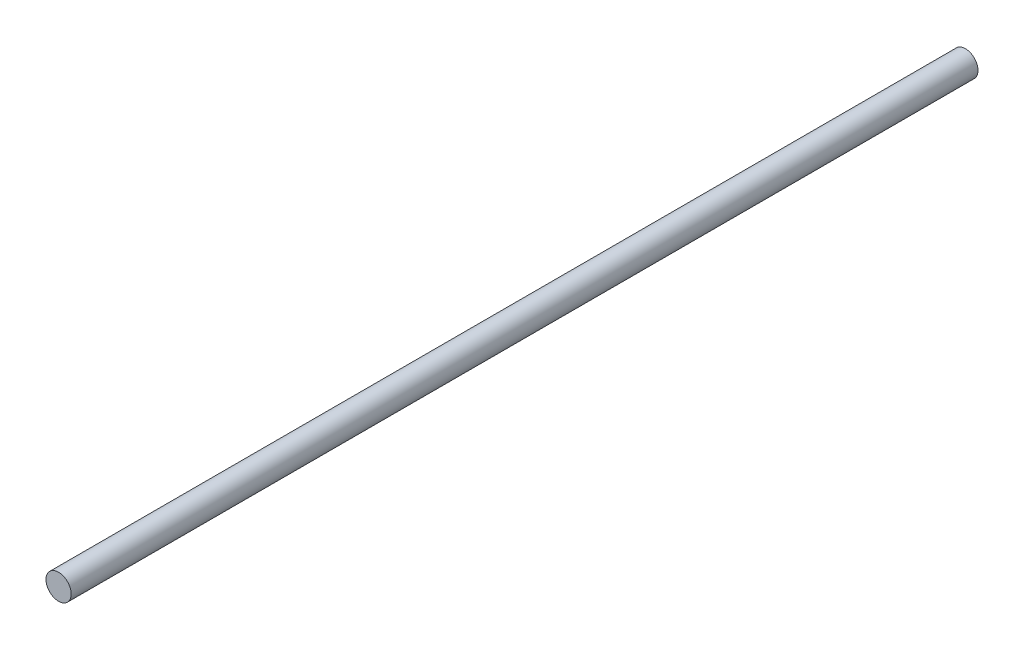
ISO-10303-21;
HEADER;
FILE_DESCRIPTION(('STEP AP214'),'2;1');
FILE_NAME('part.step','',(''),(''),'','','');
FILE_SCHEMA(('AUTOMOTIVE_DESIGN { 1 0 10303 214 1 1 1 1 }'));
ENDSEC;
DATA;
#1=APPLICATION_CONTEXT('core data for automotive mechanical design processes');
#2=APPLICATION_PROTOCOL_DEFINITION('international standard','automotive_design',2000,#1);
#3=PRODUCT_CONTEXT('',#1,'mechanical');
#4=PRODUCT('Part','Part','',(#3));
#5=PRODUCT_RELATED_PRODUCT_CATEGORY('part','',(#4));
#6=PRODUCT_DEFINITION_FORMATION('','',#4);
#7=PRODUCT_DEFINITION_CONTEXT('part definition',#1,'design');
#8=PRODUCT_DEFINITION('design','',#6,#7);
#9=PRODUCT_DEFINITION_SHAPE('','',#8);
#10=(LENGTH_UNIT() NAMED_UNIT(*) SI_UNIT(.MILLI.,.METRE.));
#11=(NAMED_UNIT(*) PLANE_ANGLE_UNIT() SI_UNIT($,.RADIAN.));
#12=(NAMED_UNIT(*) SI_UNIT($,.STERADIAN.) SOLID_ANGLE_UNIT());
#13=UNCERTAINTY_MEASURE_WITH_UNIT(LENGTH_MEASURE(1.E-05),#10,'distance_accuracy_value','');
#14=(GEOMETRIC_REPRESENTATION_CONTEXT(3) GLOBAL_UNCERTAINTY_ASSIGNED_CONTEXT((#13)) GLOBAL_UNIT_ASSIGNED_CONTEXT((#10,
#11,#12)) REPRESENTATION_CONTEXT('',''));
#15=CARTESIAN_POINT('',(0.,0.,0.));
#16=DIRECTION('',(0.,0.,1.));
#17=DIRECTION('',(1.,0.,0.));
#18=AXIS2_PLACEMENT_3D('',#15,#16,#17);
#19=CARTESIAN_POINT('',(0.,0.,180.));
#20=DIRECTION('',(0.,0.,-1.));
#21=DIRECTION('',(-1.,0.,0.));
#22=AXIS2_PLACEMENT_3D('',#19,#20,#21);
#23=CYLINDRICAL_SURFACE('',#22,2.5);
#24=CARTESIAN_POINT('',(0.,0.,180.));
#25=DIRECTION('',(0.,0.,1.));
#26=DIRECTION('',(1.,0.,0.));
#27=AXIS2_PLACEMENT_3D('',#24,#25,#26);
#28=CIRCLE('',#27,2.5);
#29=CARTESIAN_POINT('',(2.5,0.,180.));
#30=VERTEX_POINT('',#29);
#31=EDGE_CURVE('E10',#30,#30,#28,.T.);
#32=ORIENTED_EDGE('',*,*,#31,.F.);
#33=EDGE_LOOP('',(#32));
#34=FACE_BOUND('',#33,.T.);
#35=CARTESIAN_POINT('',(0.,0.,0.));
#36=DIRECTION('',(0.,0.,1.));
#37=DIRECTION('',(1.,0.,0.));
#38=AXIS2_PLACEMENT_3D('',#35,#36,#37);
#39=CIRCLE('',#38,2.5);
#40=CARTESIAN_POINT('',(2.5,0.,0.));
#41=VERTEX_POINT('',#40);
#42=EDGE_CURVE('E40',#41,#41,#39,.T.);
#43=ORIENTED_EDGE('',*,*,#42,.T.);
#44=EDGE_LOOP('',(#43));
#45=FACE_BOUND('',#44,.T.);
#46=ADVANCED_FACE('F37',(#34,#45),#23,.T.);
#47=CARTESIAN_POINT('',(0.,0.,180.));
#48=DIRECTION('',(0.,0.,1.));
#49=DIRECTION('',(1.,0.,0.));
#50=AXIS2_PLACEMENT_3D('',#47,#48,#49);
#51=PLANE('',#50);
#52=ORIENTED_EDGE('',*,*,#31,.T.);
#53=EDGE_LOOP('',(#52));
#54=FACE_BOUND('',#53,.T.);
#55=ADVANCED_FACE('F54',(#54),#51,.T.);
#56=CARTESIAN_POINT('',(0.,0.,0.));
#57=DIRECTION('',(0.,0.,1.));
#58=DIRECTION('',(1.,0.,0.));
#59=AXIS2_PLACEMENT_3D('',#56,#57,#58);
#60=PLANE('',#59);
#61=ORIENTED_EDGE('',*,*,#42,.F.);
#62=EDGE_LOOP('',(#61));
#63=FACE_BOUND('',#62,.T.);
#64=ADVANCED_FACE('F52',(#63),#60,.F.);
#65=CLOSED_SHELL('',(#46,#55,#64));
#66=MANIFOLD_SOLID_BREP('B2',#65);
#67=ADVANCED_BREP_SHAPE_REPRESENTATION('',(#18,#66),#14);
#68=SHAPE_DEFINITION_REPRESENTATION(#9,#67);
ENDSEC;
END-ISO-10303-21;
